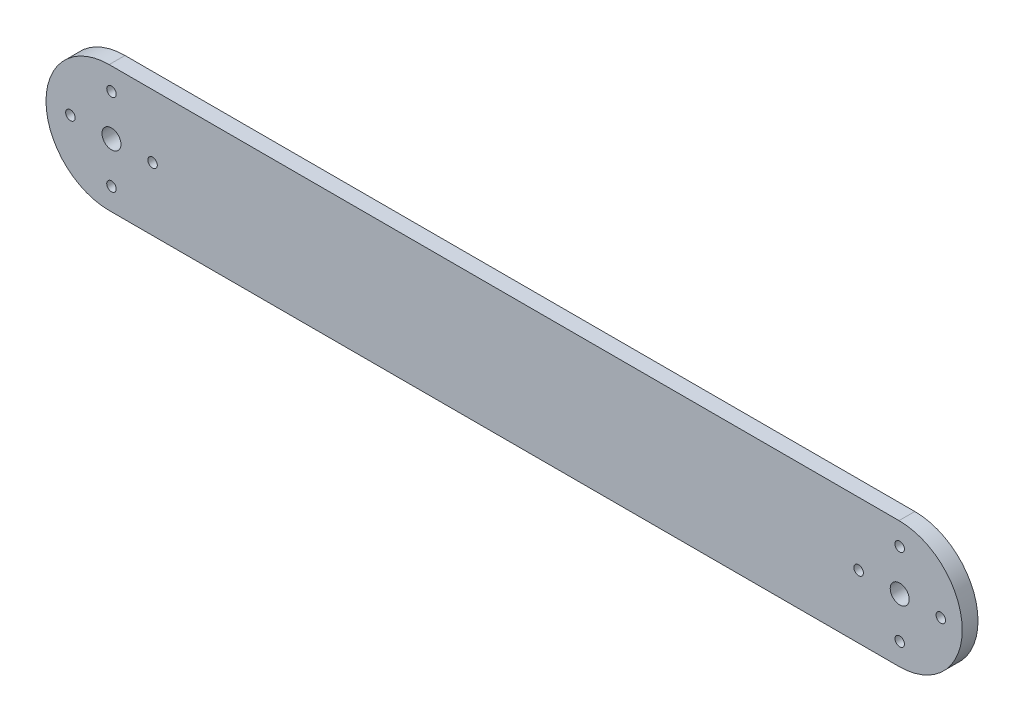
ISO-10303-21;
HEADER;
FILE_DESCRIPTION(('STEP AP214'),'2;1');
FILE_NAME('part.step','',(''),(''),'','','');
FILE_SCHEMA(('AUTOMOTIVE_DESIGN { 1 0 10303 214 1 1 1 1 }'));
ENDSEC;
DATA;
#1=APPLICATION_CONTEXT('core data for automotive mechanical design processes');
#2=APPLICATION_PROTOCOL_DEFINITION('international standard','automotive_design',2000,#1);
#3=PRODUCT_CONTEXT('',#1,'mechanical');
#4=PRODUCT('Part','Part','',(#3));
#5=PRODUCT_RELATED_PRODUCT_CATEGORY('part','',(#4));
#6=PRODUCT_DEFINITION_FORMATION('','',#4);
#7=PRODUCT_DEFINITION_CONTEXT('part definition',#1,'design');
#8=PRODUCT_DEFINITION('design','',#6,#7);
#9=PRODUCT_DEFINITION_SHAPE('','',#8);
#10=(LENGTH_UNIT() NAMED_UNIT(*) SI_UNIT(.MILLI.,.METRE.));
#11=(NAMED_UNIT(*) PLANE_ANGLE_UNIT() SI_UNIT($,.RADIAN.));
#12=(NAMED_UNIT(*) SI_UNIT($,.STERADIAN.) SOLID_ANGLE_UNIT());
#13=UNCERTAINTY_MEASURE_WITH_UNIT(LENGTH_MEASURE(1.E-05),#10,'distance_accuracy_value','');
#14=(GEOMETRIC_REPRESENTATION_CONTEXT(3) GLOBAL_UNCERTAINTY_ASSIGNED_CONTEXT((#13)) GLOBAL_UNIT_ASSIGNED_CONTEXT((#10,
#11,#12)) REPRESENTATION_CONTEXT('',''));
#15=CARTESIAN_POINT('',(0.,0.,0.));
#16=DIRECTION('',(0.,0.,1.));
#17=DIRECTION('',(1.,0.,0.));
#18=AXIS2_PLACEMENT_3D('',#15,#16,#17);
#19=CARTESIAN_POINT('',(125.,0.,5.));
#20=DIRECTION('',(0.,0.,-1.));
#21=DIRECTION('',(-1.,0.,0.));
#22=AXIS2_PLACEMENT_3D('',#19,#20,#21);
#23=CYLINDRICAL_SURFACE('',#22,20.);
#24=CARTESIAN_POINT('',(125.,0.,0.));
#25=DIRECTION('',(0.,0.,1.));
#26=DIRECTION('',(1.,0.,0.));
#27=AXIS2_PLACEMENT_3D('',#24,#25,#26);
#28=CIRCLE('',#27,20.);
#29=CARTESIAN_POINT('',(125.,-20.,0.));
#30=VERTEX_POINT('',#29);
#31=CARTESIAN_POINT('',(125.,20.,0.));
#32=VERTEX_POINT('',#31);
#33=EDGE_CURVE('E95',#30,#32,#28,.T.);
#34=ORIENTED_EDGE('',*,*,#33,.T.);
#35=DIRECTION('',(0.,0.,-1.));
#36=VECTOR('',#35,1.);
#37=CARTESIAN_POINT('',(125.,20.,5.));
#38=LINE('',#37,#36);
#39=CARTESIAN_POINT('',(125.,20.,5.));
#40=VERTEX_POINT('',#39);
#41=EDGE_CURVE('E11',#40,#32,#38,.T.);
#42=ORIENTED_EDGE('',*,*,#41,.F.);
#43=CARTESIAN_POINT('',(125.,0.,5.));
#44=DIRECTION('',(0.,0.,1.));
#45=DIRECTION('',(1.,0.,0.));
#46=AXIS2_PLACEMENT_3D('',#43,#44,#45);
#47=CIRCLE('',#46,20.);
#48=CARTESIAN_POINT('',(125.,-20.,5.));
#49=VERTEX_POINT('',#48);
#50=EDGE_CURVE('E83',#49,#40,#47,.T.);
#51=ORIENTED_EDGE('',*,*,#50,.F.);
#52=DIRECTION('',(0.,0.,-1.));
#53=VECTOR('',#52,1.);
#54=CARTESIAN_POINT('',(125.,-20.,5.));
#55=LINE('',#54,#53);
#56=EDGE_CURVE('E91',#49,#30,#55,.T.);
#57=ORIENTED_EDGE('',*,*,#56,.T.);
#58=EDGE_LOOP('',(#34,#42,#51,#57));
#59=FACE_BOUND('',#58,.T.);
#60=ADVANCED_FACE('F32',(#59),#23,.T.);
#61=CARTESIAN_POINT('',(125.,20.,5.));
#62=DIRECTION('',(0.,-1.,0.));
#63=DIRECTION('',(1.,0.,0.));
#64=AXIS2_PLACEMENT_3D('',#61,#62,#63);
#65=PLANE('',#64);
#66=DIRECTION('',(-1.,0.,0.));
#67=VECTOR('',#66,1.);
#68=CARTESIAN_POINT('',(125.,20.,0.));
#69=LINE('',#68,#67);
#70=CARTESIAN_POINT('',(-125.,20.,0.));
#71=VERTEX_POINT('',#70);
#72=EDGE_CURVE('E87',#32,#71,#69,.T.);
#73=ORIENTED_EDGE('',*,*,#72,.T.);
#74=DIRECTION('',(0.,0.,-1.));
#75=VECTOR('',#74,1.);
#76=CARTESIAN_POINT('',(-125.,20.,5.));
#77=LINE('',#76,#75);
#78=CARTESIAN_POINT('',(-125.,20.,5.));
#79=VERTEX_POINT('',#78);
#80=EDGE_CURVE('E40',#79,#71,#77,.T.);
#81=ORIENTED_EDGE('',*,*,#80,.F.);
#82=DIRECTION('',(-1.,0.,0.));
#83=VECTOR('',#82,1.);
#84=CARTESIAN_POINT('',(125.,20.,5.));
#85=LINE('',#84,#83);
#86=EDGE_CURVE('E78',#40,#79,#85,.T.);
#87=ORIENTED_EDGE('',*,*,#86,.F.);
#88=ORIENTED_EDGE('',*,*,#41,.T.);
#89=EDGE_LOOP('',(#73,#81,#87,#88));
#90=FACE_BOUND('',#89,.T.);
#91=ADVANCED_FACE('F86',(#90),#65,.F.);
#92=CARTESIAN_POINT('',(-125.,0.,5.));
#93=DIRECTION('',(0.,0.,-1.));
#94=DIRECTION('',(-1.,0.,0.));
#95=AXIS2_PLACEMENT_3D('',#92,#93,#94);
#96=CYLINDRICAL_SURFACE('',#95,20.);
#97=CARTESIAN_POINT('',(-125.,0.,0.));
#98=DIRECTION('',(0.,0.,1.));
#99=DIRECTION('',(1.,0.,0.));
#100=AXIS2_PLACEMENT_3D('',#97,#98,#99);
#101=CIRCLE('',#100,20.);
#102=CARTESIAN_POINT('',(-125.,-20.,0.));
#103=VERTEX_POINT('',#102);
#104=EDGE_CURVE('E65',#71,#103,#101,.T.);
#105=ORIENTED_EDGE('',*,*,#104,.T.);
#106=DIRECTION('',(0.,0.,-1.));
#107=VECTOR('',#106,1.);
#108=CARTESIAN_POINT('',(-125.,-20.,5.));
#109=LINE('',#108,#107);
#110=CARTESIAN_POINT('',(-125.,-20.,5.));
#111=VERTEX_POINT('',#110);
#112=EDGE_CURVE('E88',#111,#103,#109,.T.);
#113=ORIENTED_EDGE('',*,*,#112,.F.);
#114=CARTESIAN_POINT('',(-125.,0.,5.));
#115=DIRECTION('',(0.,0.,1.));
#116=DIRECTION('',(1.,0.,0.));
#117=AXIS2_PLACEMENT_3D('',#114,#115,#116);
#118=CIRCLE('',#117,20.);
#119=EDGE_CURVE('E81',#79,#111,#118,.T.);
#120=ORIENTED_EDGE('',*,*,#119,.F.);
#121=ORIENTED_EDGE('',*,*,#80,.T.);
#122=EDGE_LOOP('',(#105,#113,#120,#121));
#123=FACE_BOUND('',#122,.T.);
#124=ADVANCED_FACE('F89',(#123),#96,.T.);
#125=CARTESIAN_POINT('',(125.,-20.,5.));
#126=DIRECTION('',(0.,1.,0.));
#127=DIRECTION('',(-1.,0.,0.));
#128=AXIS2_PLACEMENT_3D('',#125,#126,#127);
#129=PLANE('',#128);
#130=DIRECTION('',(1.,0.,0.));
#131=VECTOR('',#130,1.);
#132=CARTESIAN_POINT('',(125.,-20.,0.));
#133=LINE('',#132,#131);
#134=EDGE_CURVE('E71',#103,#30,#133,.T.);
#135=ORIENTED_EDGE('',*,*,#134,.T.);
#136=ORIENTED_EDGE('',*,*,#56,.F.);
#137=DIRECTION('',(1.,0.,0.));
#138=VECTOR('',#137,1.);
#139=CARTESIAN_POINT('',(125.,-20.,5.));
#140=LINE('',#139,#138);
#141=EDGE_CURVE('E48',#111,#49,#140,.T.);
#142=ORIENTED_EDGE('',*,*,#141,.F.);
#143=ORIENTED_EDGE('',*,*,#112,.T.);
#144=EDGE_LOOP('',(#135,#136,#142,#143));
#145=FACE_BOUND('',#144,.T.);
#146=ADVANCED_FACE('F103',(#145),#129,.F.);
#147=CARTESIAN_POINT('',(125.,0.,5.));
#148=DIRECTION('',(0.,0.,1.));
#149=DIRECTION('',(1.,0.,0.));
#150=AXIS2_PLACEMENT_3D('',#147,#148,#149);
#151=PLANE('',#150);
#152=CARTESIAN_POINT('',(-124.274977313956,0.,5.));
#153=DIRECTION('',(0.,0.,1.));
#154=DIRECTION('',(1.,0.,0.));
#155=AXIS2_PLACEMENT_3D('',#152,#153,#154);
#156=CIRCLE('',#155,2.99999999999999);
#157=CARTESIAN_POINT('',(-121.274977313956,0.,5.));
#158=VERTEX_POINT('',#157);
#159=EDGE_CURVE('E160',#158,#158,#156,.T.);
#160=ORIENTED_EDGE('',*,*,#159,.F.);
#161=EDGE_LOOP('',(#160));
#162=FACE_BOUND('',#161,.T.);
#163=CARTESIAN_POINT('',(125.216266838887,-8.82627304576999E-12,5.));
#164=DIRECTION('',(0.,0.,-1.));
#165=DIRECTION('',(-1.,0.,0.));
#166=AXIS2_PLACEMENT_3D('',#163,#164,#165);
#167=CIRCLE('',#166,3.00000000000001);
#168=CARTESIAN_POINT('',(122.216266838887,-8.82627304576999E-12,5.));
#169=VERTEX_POINT('',#168);
#170=EDGE_CURVE('E154',#169,#169,#167,.T.);
#171=ORIENTED_EDGE('',*,*,#170,.T.);
#172=EDGE_LOOP('',(#171));
#173=FACE_BOUND('',#172,.T.);
#174=CARTESIAN_POINT('',(112.216266838883,0.,5.));
#175=DIRECTION('',(0.,0.,1.));
#176=DIRECTION('',(1.,0.,0.));
#177=AXIS2_PLACEMENT_3D('',#174,#175,#176);
#178=CIRCLE('',#177,1.5);
#179=CARTESIAN_POINT('',(113.716266838883,0.,5.));
#180=VERTEX_POINT('',#179);
#181=EDGE_CURVE('E151',#180,#180,#178,.T.);
#182=ORIENTED_EDGE('',*,*,#181,.F.);
#183=EDGE_LOOP('',(#182));
#184=FACE_BOUND('',#183,.T.);
#185=CARTESIAN_POINT('',(125.216266838883,-13.,5.));
#186=DIRECTION('',(0.,0.,1.));
#187=DIRECTION('',(1.,0.,0.));
#188=AXIS2_PLACEMENT_3D('',#185,#186,#187);
#189=CIRCLE('',#188,1.5);
#190=CARTESIAN_POINT('',(126.716266838883,-13.,5.));
#191=VERTEX_POINT('',#190);
#192=EDGE_CURVE('E145',#191,#191,#189,.T.);
#193=ORIENTED_EDGE('',*,*,#192,.F.);
#194=EDGE_LOOP('',(#193));
#195=FACE_BOUND('',#194,.T.);
#196=CARTESIAN_POINT('',(138.216266838883,0.,5.));
#197=DIRECTION('',(0.,0.,1.));
#198=DIRECTION('',(1.,0.,0.));
#199=AXIS2_PLACEMENT_3D('',#196,#197,#198);
#200=CIRCLE('',#199,1.5);
#201=CARTESIAN_POINT('',(139.716266838883,0.,5.));
#202=VERTEX_POINT('',#201);
#203=EDGE_CURVE('E139',#202,#202,#200,.T.);
#204=ORIENTED_EDGE('',*,*,#203,.F.);
#205=EDGE_LOOP('',(#204));
#206=FACE_BOUND('',#205,.T.);
#207=CARTESIAN_POINT('',(125.216266838883,13.,5.));
#208=DIRECTION('',(0.,0.,1.));
#209=DIRECTION('',(1.,0.,0.));
#210=AXIS2_PLACEMENT_3D('',#207,#208,#209);
#211=CIRCLE('',#210,1.5);
#212=CARTESIAN_POINT('',(126.716266838883,13.,5.));
#213=VERTEX_POINT('',#212);
#214=EDGE_CURVE('E133',#213,#213,#211,.T.);
#215=ORIENTED_EDGE('',*,*,#214,.F.);
#216=EDGE_LOOP('',(#215));
#217=FACE_BOUND('',#216,.T.);
#218=CARTESIAN_POINT('',(-137.274977313956,0.,5.));
#219=DIRECTION('',(0.,0.,1.));
#220=DIRECTION('',(1.,0.,0.));
#221=AXIS2_PLACEMENT_3D('',#218,#219,#220);
#222=CIRCLE('',#221,1.5);
#223=CARTESIAN_POINT('',(-135.774977313956,0.,5.));
#224=VERTEX_POINT('',#223);
#225=EDGE_CURVE('E127',#224,#224,#222,.T.);
#226=ORIENTED_EDGE('',*,*,#225,.F.);
#227=EDGE_LOOP('',(#226));
#228=FACE_BOUND('',#227,.T.);
#229=CARTESIAN_POINT('',(-124.274977313956,-13.,5.));
#230=DIRECTION('',(0.,0.,1.));
#231=DIRECTION('',(1.,0.,0.));
#232=AXIS2_PLACEMENT_3D('',#229,#230,#231);
#233=CIRCLE('',#232,1.50000000000001);
#234=CARTESIAN_POINT('',(-122.774977313956,-13.,5.));
#235=VERTEX_POINT('',#234);
#236=EDGE_CURVE('E121',#235,#235,#233,.T.);
#237=ORIENTED_EDGE('',*,*,#236,.F.);
#238=EDGE_LOOP('',(#237));
#239=FACE_BOUND('',#238,.T.);
#240=CARTESIAN_POINT('',(-111.274977313956,0.,5.));
#241=DIRECTION('',(0.,0.,1.));
#242=DIRECTION('',(1.,0.,0.));
#243=AXIS2_PLACEMENT_3D('',#240,#241,#242);
#244=CIRCLE('',#243,1.5);
#245=CARTESIAN_POINT('',(-109.774977313956,0.,5.));
#246=VERTEX_POINT('',#245);
#247=EDGE_CURVE('E115',#246,#246,#244,.T.);
#248=ORIENTED_EDGE('',*,*,#247,.F.);
#249=EDGE_LOOP('',(#248));
#250=FACE_BOUND('',#249,.T.);
#251=CARTESIAN_POINT('',(-124.274977313956,13.,5.));
#252=DIRECTION('',(0.,0.,1.));
#253=DIRECTION('',(1.,0.,0.));
#254=AXIS2_PLACEMENT_3D('',#251,#252,#253);
#255=CIRCLE('',#254,1.5);
#256=CARTESIAN_POINT('',(-122.774977313956,13.,5.));
#257=VERTEX_POINT('',#256);
#258=EDGE_CURVE('E109',#257,#257,#255,.T.);
#259=ORIENTED_EDGE('',*,*,#258,.F.);
#260=EDGE_LOOP('',(#259));
#261=FACE_BOUND('',#260,.T.);
#262=ORIENTED_EDGE('',*,*,#50,.T.);
#263=ORIENTED_EDGE('',*,*,#86,.T.);
#264=ORIENTED_EDGE('',*,*,#119,.T.);
#265=ORIENTED_EDGE('',*,*,#141,.T.);
#266=EDGE_LOOP('',(#262,#263,#264,#265));
#267=FACE_BOUND('',#266,.T.);
#268=ADVANCED_FACE('F79',(#162,#173,#184,#195,#206,#217,#228,#239,#250,#261,#267),#151,.T.);
#269=CARTESIAN_POINT('',(125.,0.,0.));
#270=DIRECTION('',(0.,0.,1.));
#271=DIRECTION('',(1.,0.,0.));
#272=AXIS2_PLACEMENT_3D('',#269,#270,#271);
#273=PLANE('',#272);
#274=CARTESIAN_POINT('',(-124.274977313956,0.,0.));
#275=DIRECTION('',(0.,0.,-1.));
#276=DIRECTION('',(-1.,0.,0.));
#277=AXIS2_PLACEMENT_3D('',#274,#275,#276);
#278=CIRCLE('',#277,2.99999999999999);
#279=CARTESIAN_POINT('',(-127.274977313956,0.,0.));
#280=VERTEX_POINT('',#279);
#281=EDGE_CURVE('E165',#280,#280,#278,.T.);
#282=ORIENTED_EDGE('',*,*,#281,.F.);
#283=EDGE_LOOP('',(#282));
#284=FACE_BOUND('',#283,.T.);
#285=CARTESIAN_POINT('',(125.216266838887,-8.82627304576999E-12,0.));
#286=DIRECTION('',(0.,0.,-1.));
#287=DIRECTION('',(-1.,0.,0.));
#288=AXIS2_PLACEMENT_3D('',#285,#286,#287);
#289=CIRCLE('',#288,3.00000000000001);
#290=CARTESIAN_POINT('',(122.216266838887,-8.82627304576999E-12,0.));
#291=VERTEX_POINT('',#290);
#292=EDGE_CURVE('E157',#291,#291,#289,.T.);
#293=ORIENTED_EDGE('',*,*,#292,.F.);
#294=EDGE_LOOP('',(#293));
#295=FACE_BOUND('',#294,.T.);
#296=CARTESIAN_POINT('',(112.216266838883,0.,0.));
#297=DIRECTION('',(0.,0.,1.));
#298=DIRECTION('',(1.,0.,0.));
#299=AXIS2_PLACEMENT_3D('',#296,#297,#298);
#300=CIRCLE('',#299,1.5);
#301=CARTESIAN_POINT('',(113.716266838883,0.,0.));
#302=VERTEX_POINT('',#301);
#303=EDGE_CURVE('E148',#302,#302,#300,.T.);
#304=ORIENTED_EDGE('',*,*,#303,.T.);
#305=EDGE_LOOP('',(#304));
#306=FACE_BOUND('',#305,.T.);
#307=CARTESIAN_POINT('',(125.216266838883,-13.,0.));
#308=DIRECTION('',(0.,0.,1.));
#309=DIRECTION('',(1.,0.,0.));
#310=AXIS2_PLACEMENT_3D('',#307,#308,#309);
#311=CIRCLE('',#310,1.5);
#312=CARTESIAN_POINT('',(126.716266838883,-13.,0.));
#313=VERTEX_POINT('',#312);
#314=EDGE_CURVE('E142',#313,#313,#311,.T.);
#315=ORIENTED_EDGE('',*,*,#314,.T.);
#316=EDGE_LOOP('',(#315));
#317=FACE_BOUND('',#316,.T.);
#318=CARTESIAN_POINT('',(138.216266838883,0.,0.));
#319=DIRECTION('',(0.,0.,1.));
#320=DIRECTION('',(1.,0.,0.));
#321=AXIS2_PLACEMENT_3D('',#318,#319,#320);
#322=CIRCLE('',#321,1.5);
#323=CARTESIAN_POINT('',(139.716266838883,0.,0.));
#324=VERTEX_POINT('',#323);
#325=EDGE_CURVE('E136',#324,#324,#322,.T.);
#326=ORIENTED_EDGE('',*,*,#325,.T.);
#327=EDGE_LOOP('',(#326));
#328=FACE_BOUND('',#327,.T.);
#329=CARTESIAN_POINT('',(125.216266838883,13.,0.));
#330=DIRECTION('',(0.,0.,1.));
#331=DIRECTION('',(1.,0.,0.));
#332=AXIS2_PLACEMENT_3D('',#329,#330,#331);
#333=CIRCLE('',#332,1.5);
#334=CARTESIAN_POINT('',(126.716266838883,13.,0.));
#335=VERTEX_POINT('',#334);
#336=EDGE_CURVE('E130',#335,#335,#333,.T.);
#337=ORIENTED_EDGE('',*,*,#336,.T.);
#338=EDGE_LOOP('',(#337));
#339=FACE_BOUND('',#338,.T.);
#340=CARTESIAN_POINT('',(-137.274977313956,0.,0.));
#341=DIRECTION('',(0.,0.,1.));
#342=DIRECTION('',(1.,0.,0.));
#343=AXIS2_PLACEMENT_3D('',#340,#341,#342);
#344=CIRCLE('',#343,1.5);
#345=CARTESIAN_POINT('',(-135.774977313956,0.,0.));
#346=VERTEX_POINT('',#345);
#347=EDGE_CURVE('E124',#346,#346,#344,.T.);
#348=ORIENTED_EDGE('',*,*,#347,.T.);
#349=EDGE_LOOP('',(#348));
#350=FACE_BOUND('',#349,.T.);
#351=CARTESIAN_POINT('',(-124.274977313956,-13.,0.));
#352=DIRECTION('',(0.,0.,1.));
#353=DIRECTION('',(1.,0.,0.));
#354=AXIS2_PLACEMENT_3D('',#351,#352,#353);
#355=CIRCLE('',#354,1.50000000000001);
#356=CARTESIAN_POINT('',(-122.774977313956,-13.,0.));
#357=VERTEX_POINT('',#356);
#358=EDGE_CURVE('E118',#357,#357,#355,.T.);
#359=ORIENTED_EDGE('',*,*,#358,.T.);
#360=EDGE_LOOP('',(#359));
#361=FACE_BOUND('',#360,.T.);
#362=CARTESIAN_POINT('',(-111.274977313956,0.,0.));
#363=DIRECTION('',(0.,0.,1.));
#364=DIRECTION('',(1.,0.,0.));
#365=AXIS2_PLACEMENT_3D('',#362,#363,#364);
#366=CIRCLE('',#365,1.5);
#367=CARTESIAN_POINT('',(-109.774977313956,0.,0.));
#368=VERTEX_POINT('',#367);
#369=EDGE_CURVE('E112',#368,#368,#366,.T.);
#370=ORIENTED_EDGE('',*,*,#369,.T.);
#371=EDGE_LOOP('',(#370));
#372=FACE_BOUND('',#371,.T.);
#373=CARTESIAN_POINT('',(-124.274977313956,13.,0.));
#374=DIRECTION('',(0.,0.,1.));
#375=DIRECTION('',(1.,0.,0.));
#376=AXIS2_PLACEMENT_3D('',#373,#374,#375);
#377=CIRCLE('',#376,1.5);
#378=CARTESIAN_POINT('',(-122.774977313956,13.,0.));
#379=VERTEX_POINT('',#378);
#380=EDGE_CURVE('E98',#379,#379,#377,.T.);
#381=ORIENTED_EDGE('',*,*,#380,.T.);
#382=EDGE_LOOP('',(#381));
#383=FACE_BOUND('',#382,.T.);
#384=ORIENTED_EDGE('',*,*,#33,.F.);
#385=ORIENTED_EDGE('',*,*,#134,.F.);
#386=ORIENTED_EDGE('',*,*,#104,.F.);
#387=ORIENTED_EDGE('',*,*,#72,.F.);
#388=EDGE_LOOP('',(#384,#385,#386,#387));
#389=FACE_BOUND('',#388,.T.);
#390=ADVANCED_FACE('F106',(#284,#295,#306,#317,#328,#339,#350,#361,#372,#383,#389),#273,.F.);
#391=CARTESIAN_POINT('',(-124.274977313956,13.,0.));
#392=DIRECTION('',(0.,0.,1.));
#393=DIRECTION('',(1.,0.,0.));
#394=AXIS2_PLACEMENT_3D('',#391,#392,#393);
#395=CYLINDRICAL_SURFACE('',#394,1.5);
#396=ORIENTED_EDGE('',*,*,#380,.F.);
#397=EDGE_LOOP('',(#396));
#398=FACE_BOUND('',#397,.T.);
#399=ORIENTED_EDGE('',*,*,#258,.T.);
#400=EDGE_LOOP('',(#399));
#401=FACE_BOUND('',#400,.T.);
#402=ADVANCED_FACE('F173',(#398,#401),#395,.F.);
#403=CARTESIAN_POINT('',(-111.274977313956,0.,0.));
#404=DIRECTION('',(0.,0.,1.));
#405=DIRECTION('',(1.,0.,0.));
#406=AXIS2_PLACEMENT_3D('',#403,#404,#405);
#407=CYLINDRICAL_SURFACE('',#406,1.5);
#408=ORIENTED_EDGE('',*,*,#369,.F.);
#409=EDGE_LOOP('',(#408));
#410=FACE_BOUND('',#409,.T.);
#411=ORIENTED_EDGE('',*,*,#247,.T.);
#412=EDGE_LOOP('',(#411));
#413=FACE_BOUND('',#412,.T.);
#414=ADVANCED_FACE('F195',(#410,#413),#407,.F.);
#415=CARTESIAN_POINT('',(-124.274977313956,-13.,0.));
#416=DIRECTION('',(0.,0.,1.));
#417=DIRECTION('',(1.,0.,0.));
#418=AXIS2_PLACEMENT_3D('',#415,#416,#417);
#419=CYLINDRICAL_SURFACE('',#418,1.50000000000001);
#420=ORIENTED_EDGE('',*,*,#358,.F.);
#421=EDGE_LOOP('',(#420));
#422=FACE_BOUND('',#421,.T.);
#423=ORIENTED_EDGE('',*,*,#236,.T.);
#424=EDGE_LOOP('',(#423));
#425=FACE_BOUND('',#424,.T.);
#426=ADVANCED_FACE('F239',(#422,#425),#419,.F.);
#427=CARTESIAN_POINT('',(-137.274977313956,0.,0.));
#428=DIRECTION('',(0.,0.,1.));
#429=DIRECTION('',(1.,0.,0.));
#430=AXIS2_PLACEMENT_3D('',#427,#428,#429);
#431=CYLINDRICAL_SURFACE('',#430,1.5);
#432=ORIENTED_EDGE('',*,*,#347,.F.);
#433=EDGE_LOOP('',(#432));
#434=FACE_BOUND('',#433,.T.);
#435=ORIENTED_EDGE('',*,*,#225,.T.);
#436=EDGE_LOOP('',(#435));
#437=FACE_BOUND('',#436,.T.);
#438=ADVANCED_FACE('F249',(#434,#437),#431,.F.);
#439=CARTESIAN_POINT('',(125.216266838883,13.,0.));
#440=DIRECTION('',(0.,0.,1.));
#441=DIRECTION('',(1.,0.,0.));
#442=AXIS2_PLACEMENT_3D('',#439,#440,#441);
#443=CYLINDRICAL_SURFACE('',#442,1.5);
#444=ORIENTED_EDGE('',*,*,#336,.F.);
#445=EDGE_LOOP('',(#444));
#446=FACE_BOUND('',#445,.T.);
#447=ORIENTED_EDGE('',*,*,#214,.T.);
#448=EDGE_LOOP('',(#447));
#449=FACE_BOUND('',#448,.T.);
#450=ADVANCED_FACE('F259',(#446,#449),#443,.F.);
#451=CARTESIAN_POINT('',(138.216266838883,0.,0.));
#452=DIRECTION('',(0.,0.,1.));
#453=DIRECTION('',(1.,0.,0.));
#454=AXIS2_PLACEMENT_3D('',#451,#452,#453);
#455=CYLINDRICAL_SURFACE('',#454,1.5);
#456=ORIENTED_EDGE('',*,*,#325,.F.);
#457=EDGE_LOOP('',(#456));
#458=FACE_BOUND('',#457,.T.);
#459=ORIENTED_EDGE('',*,*,#203,.T.);
#460=EDGE_LOOP('',(#459));
#461=FACE_BOUND('',#460,.T.);
#462=ADVANCED_FACE('F269',(#458,#461),#455,.F.);
#463=CARTESIAN_POINT('',(125.216266838883,-13.,0.));
#464=DIRECTION('',(0.,0.,1.));
#465=DIRECTION('',(1.,0.,0.));
#466=AXIS2_PLACEMENT_3D('',#463,#464,#465);
#467=CYLINDRICAL_SURFACE('',#466,1.5);
#468=ORIENTED_EDGE('',*,*,#314,.F.);
#469=EDGE_LOOP('',(#468));
#470=FACE_BOUND('',#469,.T.);
#471=ORIENTED_EDGE('',*,*,#192,.T.);
#472=EDGE_LOOP('',(#471));
#473=FACE_BOUND('',#472,.T.);
#474=ADVANCED_FACE('F279',(#470,#473),#467,.F.);
#475=CARTESIAN_POINT('',(112.216266838883,0.,0.));
#476=DIRECTION('',(0.,0.,1.));
#477=DIRECTION('',(1.,0.,0.));
#478=AXIS2_PLACEMENT_3D('',#475,#476,#477);
#479=CYLINDRICAL_SURFACE('',#478,1.5);
#480=ORIENTED_EDGE('',*,*,#303,.F.);
#481=EDGE_LOOP('',(#480));
#482=FACE_BOUND('',#481,.T.);
#483=ORIENTED_EDGE('',*,*,#181,.T.);
#484=EDGE_LOOP('',(#483));
#485=FACE_BOUND('',#484,.T.);
#486=ADVANCED_FACE('F289',(#482,#485),#479,.F.);
#487=CARTESIAN_POINT('',(125.216266838887,-8.82627304576999E-12,5.));
#488=DIRECTION('',(0.,0.,-1.));
#489=DIRECTION('',(-1.,0.,0.));
#490=AXIS2_PLACEMENT_3D('',#487,#488,#489);
#491=CYLINDRICAL_SURFACE('',#490,3.00000000000001);
#492=ORIENTED_EDGE('',*,*,#170,.F.);
#493=EDGE_LOOP('',(#492));
#494=FACE_BOUND('',#493,.T.);
#495=ORIENTED_EDGE('',*,*,#292,.T.);
#496=EDGE_LOOP('',(#495));
#497=FACE_BOUND('',#496,.T.);
#498=ADVANCED_FACE('F299',(#494,#497),#491,.F.);
#499=CARTESIAN_POINT('',(-124.274977313956,0.,10.));
#500=DIRECTION('',(0.,0.,-1.));
#501=DIRECTION('',(-1.,0.,0.));
#502=AXIS2_PLACEMENT_3D('',#499,#500,#501);
#503=CYLINDRICAL_SURFACE('',#502,2.99999999999999);
#504=ORIENTED_EDGE('',*,*,#159,.T.);
#505=EDGE_LOOP('',(#504));
#506=FACE_BOUND('',#505,.T.);
#507=ORIENTED_EDGE('',*,*,#281,.T.);
#508=EDGE_LOOP('',(#507));
#509=FACE_BOUND('',#508,.T.);
#510=ADVANCED_FACE('F169',(#506,#509),#503,.F.);
#511=CLOSED_SHELL('',(#60,#91,#124,#146,#268,#390,#402,#414,#426,#438,#450,#462,#474,#486,#498,#510));
#512=MANIFOLD_SOLID_BREP('B2',#511);
#513=ADVANCED_BREP_SHAPE_REPRESENTATION('',(#18,#512),#14);
#514=SHAPE_DEFINITION_REPRESENTATION(#9,#513);
ENDSEC;
END-ISO-10303-21;
